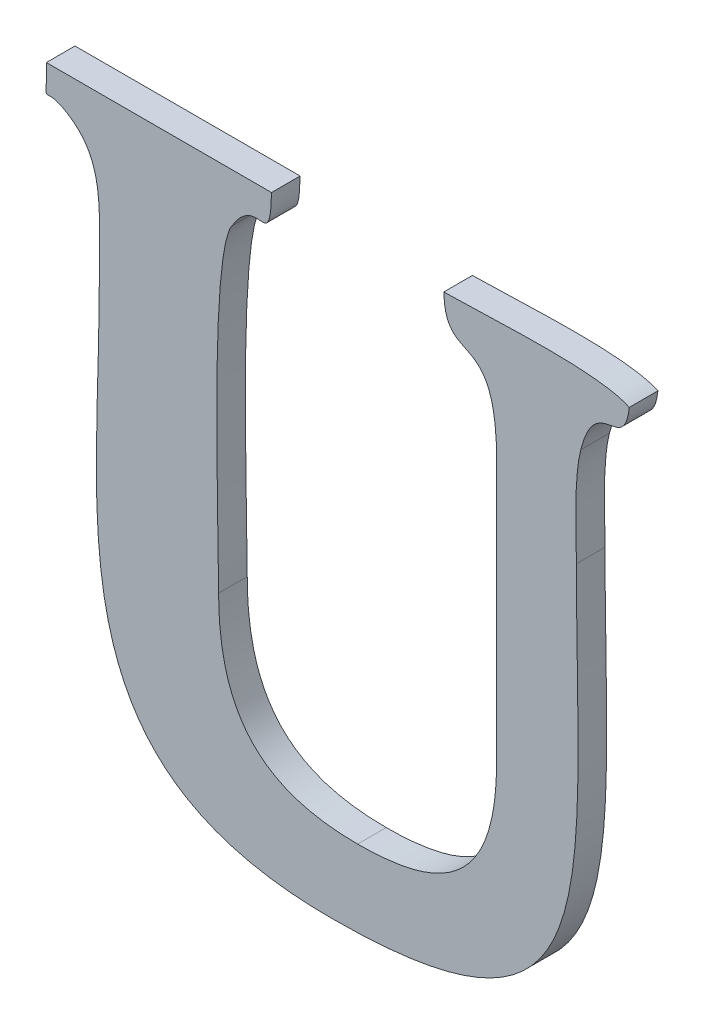
ISO-10303-21;
HEADER;
FILE_DESCRIPTION(('STEP AP214'),'2;1');
FILE_NAME('part.step','',(''),(''),'','','');
FILE_SCHEMA(('AUTOMOTIVE_DESIGN { 1 0 10303 214 1 1 1 1 }'));
ENDSEC;
DATA;
#1=APPLICATION_CONTEXT('core data for automotive mechanical design processes');
#2=APPLICATION_PROTOCOL_DEFINITION('international standard','automotive_design',2000,#1);
#3=PRODUCT_CONTEXT('',#1,'mechanical');
#4=PRODUCT('Part','Part','',(#3));
#5=PRODUCT_RELATED_PRODUCT_CATEGORY('part','',(#4));
#6=PRODUCT_DEFINITION_FORMATION('','',#4);
#7=PRODUCT_DEFINITION_CONTEXT('part definition',#1,'design');
#8=PRODUCT_DEFINITION('design','',#6,#7);
#9=PRODUCT_DEFINITION_SHAPE('','',#8);
#10=(LENGTH_UNIT() NAMED_UNIT(*) SI_UNIT(.MILLI.,.METRE.));
#11=(NAMED_UNIT(*) PLANE_ANGLE_UNIT() SI_UNIT($,.RADIAN.));
#12=(NAMED_UNIT(*) SI_UNIT($,.STERADIAN.) SOLID_ANGLE_UNIT());
#13=UNCERTAINTY_MEASURE_WITH_UNIT(LENGTH_MEASURE(1.E-05),#10,'distance_accuracy_value','');
#14=(GEOMETRIC_REPRESENTATION_CONTEXT(3) GLOBAL_UNCERTAINTY_ASSIGNED_CONTEXT((#13)) GLOBAL_UNIT_ASSIGNED_CONTEXT((#10,
#11,#12)) REPRESENTATION_CONTEXT('',''));
#15=CARTESIAN_POINT('',(0.,0.,0.));
#16=DIRECTION('',(0.,0.,1.));
#17=DIRECTION('',(1.,0.,0.));
#18=AXIS2_PLACEMENT_3D('',#15,#16,#17);
#19=CARTESIAN_POINT('',(50.2041499999998,11.218749,0.001));
#20=CARTESIAN_POINT('',(50.2041499999998,11.218749,0.));
#21=CARTESIAN_POINT('',(50.2054939999998,11.217909,0.001));
#22=CARTESIAN_POINT('',(50.2054939999998,11.217909,0.));
#23=CARTESIAN_POINT('',(50.2052559999998,11.216369,0.001));
#24=CARTESIAN_POINT('',(50.2052559999998,11.216369,0.));
#25=CARTESIAN_POINT('',(50.2052559999998,11.214017,0.001));
#26=CARTESIAN_POINT('',(50.2052559999998,11.214017,0.));
#27=B_SPLINE_SURFACE_WITH_KNOTS('',3,1,((#19,#20),(#21,#22),(#23,#24),(#25,#26)),.UNSPECIFIED.,
.F.,.F.,.F.,(4,4),(2,2),(0.8,0.866666666666667),(0.,1.),.UNSPECIFIED.);
#28=CARTESIAN_POINT('',(50.2041499999998,11.218749,0.));
#29=CARTESIAN_POINT('',(50.2054939999998,11.217909,0.));
#30=CARTESIAN_POINT('',(50.2052559999998,11.216369,0.));
#31=CARTESIAN_POINT('',(50.2052559999998,11.214017,0.));
#32=B_SPLINE_CURVE_WITH_KNOTS('',3,(#28,#29,#30,#31),.UNSPECIFIED.,.F.,.F.,(4,4),(0.8,
0.866666666666667),.UNSPECIFIED.);
#33=CARTESIAN_POINT('',(50.2041499999998,11.218749,0.));
#34=VERTEX_POINT('',#33);
#35=CARTESIAN_POINT('',(50.2052559999998,11.214017,0.));
#36=VERTEX_POINT('',#35);
#37=EDGE_CURVE('E11',#34,#36,#32,.T.);
#38=DIRECTION('',(0.,0.,-1.));
#39=VECTOR('',#38,1.);
#40=CARTESIAN_POINT('',(50.2052559999998,11.214017,0.001));
#41=LINE('',#40,#39);
#42=CARTESIAN_POINT('',(50.2052559999998,11.214017,0.001));
#43=VERTEX_POINT('',#42);
#44=EDGE_CURVE('E28',#43,#36,#41,.T.);
#45=CARTESIAN_POINT('',(50.2041499999998,11.218749,0.001));
#46=CARTESIAN_POINT('',(50.2054939999998,11.217909,0.001));
#47=CARTESIAN_POINT('',(50.2052559999998,11.216369,0.001));
#48=CARTESIAN_POINT('',(50.2052559999998,11.214017,0.001));
#49=B_SPLINE_CURVE_WITH_KNOTS('',3,(#45,#46,#47,#48),.UNSPECIFIED.,.F.,.F.,(4,4),(0.8,
0.866666666666667),.UNSPECIFIED.);
#50=CARTESIAN_POINT('',(50.2041499999998,11.218749,0.001));
#51=VERTEX_POINT('',#50);
#52=EDGE_CURVE('E333',#51,#43,#49,.T.);
#53=DIRECTION('',(0.,0.,-1.));
#54=VECTOR('',#53,1.);
#55=CARTESIAN_POINT('',(50.2041499999998,11.218749,0.001));
#56=LINE('',#55,#54);
#57=EDGE_CURVE('E40',#51,#34,#56,.T.);
#58=ORIENTED_EDGE('',*,*,#37,.T.);
#59=ORIENTED_EDGE('',*,*,#44,.F.);
#60=ORIENTED_EDGE('',*,*,#52,.F.);
#61=ORIENTED_EDGE('',*,*,#57,.T.);
#62=EDGE_LOOP('',(#58,#59,#60,#61));
#63=FACE_BOUND('',#62,.T.);
#64=ADVANCED_FACE('F17',(#63),#27,.F.);
#65=CARTESIAN_POINT('',(50.2052559999998,11.214017,0.001));
#66=CARTESIAN_POINT('',(50.2052559999998,11.214017,0.));
#67=CARTESIAN_POINT('',(50.2052419999998,11.206611,0.001));
#68=CARTESIAN_POINT('',(50.2052419999998,11.206611,0.));
#69=CARTESIAN_POINT('',(50.2036739999998,11.199009,0.001));
#70=CARTESIAN_POINT('',(50.2036739999998,11.199009,0.));
#71=CARTESIAN_POINT('',(50.2133619999998,11.199009,0.001));
#72=CARTESIAN_POINT('',(50.2133619999998,11.199009,0.));
#73=B_SPLINE_SURFACE_WITH_KNOTS('',3,1,((#65,#66),(#67,#68),(#69,#70),(#71,#72)),.UNSPECIFIED.,
.F.,.F.,.F.,(4,4),(2,2),(0.866666666666667,1.),(0.,1.),.UNSPECIFIED.);
#74=CARTESIAN_POINT('',(50.2052559999998,11.214017,0.));
#75=CARTESIAN_POINT('',(50.2052419999998,11.206611,0.));
#76=CARTESIAN_POINT('',(50.2036739999998,11.199009,0.));
#77=CARTESIAN_POINT('',(50.2133619999998,11.199009,0.));
#78=B_SPLINE_CURVE_WITH_KNOTS('',3,(#74,#75,#76,#77),.UNSPECIFIED.,.F.,.F.,(4,4),
(0.866666666666667,1.),.UNSPECIFIED.);
#79=CARTESIAN_POINT('',(50.2133619999998,11.199009,0.));
#80=VERTEX_POINT('',#79);
#81=EDGE_CURVE('E325',#36,#80,#78,.T.);
#82=DIRECTION('',(0.,0.,-1.));
#83=VECTOR('',#82,1.);
#84=CARTESIAN_POINT('',(50.2133619999998,11.199009,0.001));
#85=LINE('',#84,#83);
#86=CARTESIAN_POINT('',(50.2133619999998,11.199009,0.001));
#87=VERTEX_POINT('',#86);
#88=EDGE_CURVE('E320',#87,#80,#85,.T.);
#89=CARTESIAN_POINT('',(50.2052559999998,11.214017,0.001));
#90=CARTESIAN_POINT('',(50.2052419999998,11.206611,0.001));
#91=CARTESIAN_POINT('',(50.2036739999998,11.199009,0.001));
#92=CARTESIAN_POINT('',(50.2133619999998,11.199009,0.001));
#93=B_SPLINE_CURVE_WITH_KNOTS('',3,(#89,#90,#91,#92),.UNSPECIFIED.,.F.,.F.,(4,4),
(0.866666666666667,1.),.UNSPECIFIED.);
#94=EDGE_CURVE('E313',#43,#87,#93,.T.);
#95=ORIENTED_EDGE('',*,*,#81,.T.);
#96=ORIENTED_EDGE('',*,*,#88,.F.);
#97=ORIENTED_EDGE('',*,*,#94,.F.);
#98=ORIENTED_EDGE('',*,*,#44,.T.);
#99=EDGE_LOOP('',(#95,#96,#97,#98));
#100=FACE_BOUND('',#99,.T.);
#101=ADVANCED_FACE('F341',(#100),#73,.F.);
#102=CARTESIAN_POINT('',(50.2133619999998,11.199009,0.001));
#103=CARTESIAN_POINT('',(50.2133619999998,11.199009,0.));
#104=CARTESIAN_POINT('',(50.2232039999998,11.199009,0.001));
#105=CARTESIAN_POINT('',(50.2232039999998,11.199009,0.));
#106=CARTESIAN_POINT('',(50.2219439999998,11.203979,0.001));
#107=CARTESIAN_POINT('',(50.2219439999998,11.203979,0.));
#108=CARTESIAN_POINT('',(50.2219299999998,11.214017,0.001));
#109=CARTESIAN_POINT('',(50.2219299999998,11.214017,0.));
#110=B_SPLINE_SURFACE_WITH_KNOTS('',3,1,((#102,#103),(#104,#105),(#106,#107),(#108,#109)),
.UNSPECIFIED.,.F.,.F.,.F.,(4,4),(2,2),(0.,0.0666666666666667),(0.,1.),.UNSPECIFIED.);
#111=CARTESIAN_POINT('',(50.2133619999998,11.199009,0.));
#112=CARTESIAN_POINT('',(50.2232039999998,11.199009,0.));
#113=CARTESIAN_POINT('',(50.2219439999998,11.203979,0.));
#114=CARTESIAN_POINT('',(50.2219299999998,11.214017,0.));
#115=B_SPLINE_CURVE_WITH_KNOTS('',3,(#111,#112,#113,#114),.UNSPECIFIED.,.F.,.F.,(4,4),(0.,
0.0666666666666667),.UNSPECIFIED.);
#116=CARTESIAN_POINT('',(50.2219299999998,11.214017,0.));
#117=VERTEX_POINT('',#116);
#118=EDGE_CURVE('E308',#80,#117,#115,.T.);
#119=DIRECTION('',(0.,0.,-1.));
#120=VECTOR('',#119,1.);
#121=CARTESIAN_POINT('',(50.2219299999998,11.214017,0.001));
#122=LINE('',#121,#120);
#123=CARTESIAN_POINT('',(50.2219299999998,11.214017,0.001));
#124=VERTEX_POINT('',#123);
#125=EDGE_CURVE('E303',#124,#117,#122,.T.);
#126=CARTESIAN_POINT('',(50.2133619999998,11.199009,0.001));
#127=CARTESIAN_POINT('',(50.2232039999998,11.199009,0.001));
#128=CARTESIAN_POINT('',(50.2219439999998,11.203979,0.001));
#129=CARTESIAN_POINT('',(50.2219299999998,11.214017,0.001));
#130=B_SPLINE_CURVE_WITH_KNOTS('',3,(#126,#127,#128,#129),.UNSPECIFIED.,.F.,.F.,(4,4),(0.,
0.0666666666666667),.UNSPECIFIED.);
#131=EDGE_CURVE('E296',#87,#124,#130,.T.);
#132=ORIENTED_EDGE('',*,*,#118,.T.);
#133=ORIENTED_EDGE('',*,*,#125,.F.);
#134=ORIENTED_EDGE('',*,*,#131,.F.);
#135=ORIENTED_EDGE('',*,*,#88,.T.);
#136=EDGE_LOOP('',(#132,#133,#134,#135));
#137=FACE_BOUND('',#136,.T.);
#138=ADVANCED_FACE('F346',(#137),#110,.F.);
#139=CARTESIAN_POINT('',(50.2219299999998,11.214017,0.001));
#140=CARTESIAN_POINT('',(50.2219299999998,11.214017,0.));
#141=CARTESIAN_POINT('',(50.2219299999998,11.215151,0.001));
#142=CARTESIAN_POINT('',(50.2219299999998,11.215151,0.));
#143=CARTESIAN_POINT('',(50.2218319999998,11.216523,0.001));
#144=CARTESIAN_POINT('',(50.2218319999998,11.216523,0.));
#145=CARTESIAN_POINT('',(50.2220839999998,11.217545,0.001));
#146=CARTESIAN_POINT('',(50.2220839999998,11.217545,0.));
#147=B_SPLINE_SURFACE_WITH_KNOTS('',3,1,((#139,#140),(#141,#142),(#143,#144),(#145,#146)),
.UNSPECIFIED.,.F.,.F.,.F.,(4,4),(2,2),(0.0666666666666667,0.133333333333333),(0.,1.),.UNSPECIFIED.);
#148=CARTESIAN_POINT('',(50.2219299999998,11.214017,0.));
#149=CARTESIAN_POINT('',(50.2219299999998,11.215151,0.));
#150=CARTESIAN_POINT('',(50.2218319999998,11.216523,0.));
#151=CARTESIAN_POINT('',(50.2220839999998,11.217545,0.));
#152=B_SPLINE_CURVE_WITH_KNOTS('',3,(#148,#149,#150,#151),.UNSPECIFIED.,.F.,.F.,(4,4),
(0.0666666666666667,0.133333333333333),.UNSPECIFIED.);
#153=CARTESIAN_POINT('',(50.2220839999998,11.217545,0.));
#154=VERTEX_POINT('',#153);
#155=EDGE_CURVE('E291',#117,#154,#152,.T.);
#156=DIRECTION('',(0.,0.,-1.));
#157=VECTOR('',#156,1.);
#158=CARTESIAN_POINT('',(50.2220839999998,11.217545,0.001));
#159=LINE('',#158,#157);
#160=CARTESIAN_POINT('',(50.2220839999998,11.217545,0.001));
#161=VERTEX_POINT('',#160);
#162=EDGE_CURVE('E286',#161,#154,#159,.T.);
#163=CARTESIAN_POINT('',(50.2219299999998,11.214017,0.001));
#164=CARTESIAN_POINT('',(50.2219299999998,11.215151,0.001));
#165=CARTESIAN_POINT('',(50.2218319999998,11.216523,0.001));
#166=CARTESIAN_POINT('',(50.2220839999998,11.217545,0.001));
#167=B_SPLINE_CURVE_WITH_KNOTS('',3,(#163,#164,#165,#166),.UNSPECIFIED.,.F.,.F.,(4,4),
(0.0666666666666667,0.133333333333333),.UNSPECIFIED.);
#168=EDGE_CURVE('E279',#124,#161,#167,.T.);
#169=ORIENTED_EDGE('',*,*,#155,.T.);
#170=ORIENTED_EDGE('',*,*,#162,.F.);
#171=ORIENTED_EDGE('',*,*,#168,.F.);
#172=ORIENTED_EDGE('',*,*,#125,.T.);
#173=EDGE_LOOP('',(#169,#170,#171,#172));
#174=FACE_BOUND('',#173,.T.);
#175=ADVANCED_FACE('F352',(#174),#147,.F.);
#176=CARTESIAN_POINT('',(50.2220839999998,11.217545,0.001));
#177=CARTESIAN_POINT('',(50.2220839999998,11.217545,0.));
#178=CARTESIAN_POINT('',(50.2226159999998,11.219645,0.001));
#179=CARTESIAN_POINT('',(50.2226159999998,11.219645,0.));
#180=CARTESIAN_POINT('',(50.2235959999998,11.218049,0.001));
#181=CARTESIAN_POINT('',(50.2235959999998,11.218049,0.));
#182=CARTESIAN_POINT('',(50.2237779999998,11.219673,0.001));
#183=CARTESIAN_POINT('',(50.2237779999998,11.219673,0.));
#184=B_SPLINE_SURFACE_WITH_KNOTS('',3,1,((#176,#177),(#178,#179),(#180,#181),(#182,#183)),
.UNSPECIFIED.,.F.,.F.,.F.,(4,4),(2,2),(0.133333333333333,0.2),(0.,1.),.UNSPECIFIED.);
#185=CARTESIAN_POINT('',(50.2220839999998,11.217545,0.));
#186=CARTESIAN_POINT('',(50.2226159999998,11.219645,0.));
#187=CARTESIAN_POINT('',(50.2235959999998,11.218049,0.));
#188=CARTESIAN_POINT('',(50.2237779999998,11.219673,0.));
#189=B_SPLINE_CURVE_WITH_KNOTS('',3,(#185,#186,#187,#188),.UNSPECIFIED.,.F.,.F.,(4,4),
(0.133333333333333,0.2),.UNSPECIFIED.);
#190=CARTESIAN_POINT('',(50.2237779999998,11.219673,0.));
#191=VERTEX_POINT('',#190);
#192=EDGE_CURVE('E274',#154,#191,#189,.T.);
#193=DIRECTION('',(0.,0.,-1.));
#194=VECTOR('',#193,1.);
#195=CARTESIAN_POINT('',(50.2237779999998,11.219673,0.001));
#196=LINE('',#195,#194);
#197=CARTESIAN_POINT('',(50.2237779999998,11.219673,0.001));
#198=VERTEX_POINT('',#197);
#199=EDGE_CURVE('E269',#198,#191,#196,.T.);
#200=CARTESIAN_POINT('',(50.2220839999998,11.217545,0.001));
#201=CARTESIAN_POINT('',(50.2226159999998,11.219645,0.001));
#202=CARTESIAN_POINT('',(50.2235959999998,11.218049,0.001));
#203=CARTESIAN_POINT('',(50.2237779999998,11.219673,0.001));
#204=B_SPLINE_CURVE_WITH_KNOTS('',3,(#200,#201,#202,#203),.UNSPECIFIED.,.F.,.F.,(4,4),
(0.133333333333333,0.2),.UNSPECIFIED.);
#205=EDGE_CURVE('E262',#161,#198,#204,.T.);
#206=ORIENTED_EDGE('',*,*,#192,.T.);
#207=ORIENTED_EDGE('',*,*,#199,.F.);
#208=ORIENTED_EDGE('',*,*,#205,.F.);
#209=ORIENTED_EDGE('',*,*,#162,.T.);
#210=EDGE_LOOP('',(#206,#207,#208,#209));
#211=FACE_BOUND('',#210,.T.);
#212=ADVANCED_FACE('F356',(#211),#184,.F.);
#213=CARTESIAN_POINT('',(50.2237779999998,11.219673,0.001));
#214=CARTESIAN_POINT('',(50.2237779999998,11.219673,0.));
#215=CARTESIAN_POINT('',(50.2226579999998,11.220233,0.001));
#216=CARTESIAN_POINT('',(50.2226579999998,11.220233,0.));
#217=CARTESIAN_POINT('',(50.2187379999998,11.219925,0.001));
#218=CARTESIAN_POINT('',(50.2187379999998,11.219925,0.));
#219=CARTESIAN_POINT('',(50.2172959999998,11.219925,0.001));
#220=CARTESIAN_POINT('',(50.2172959999998,11.219925,0.));
#221=B_SPLINE_SURFACE_WITH_KNOTS('',3,1,((#213,#214),(#215,#216),(#217,#218),(#219,#220)),
.UNSPECIFIED.,.F.,.F.,.F.,(4,4),(2,2),(0.2,0.266666666666667),(0.,1.),.UNSPECIFIED.);
#222=CARTESIAN_POINT('',(50.2237779999998,11.219673,0.));
#223=CARTESIAN_POINT('',(50.2226579999998,11.220233,0.));
#224=CARTESIAN_POINT('',(50.2187379999998,11.219925,0.));
#225=CARTESIAN_POINT('',(50.2172959999998,11.219925,0.));
#226=B_SPLINE_CURVE_WITH_KNOTS('',3,(#222,#223,#224,#225),.UNSPECIFIED.,.F.,.F.,(4,4),(0.2,
0.266666666666667),.UNSPECIFIED.);
#227=CARTESIAN_POINT('',(50.2172959999998,11.219925,0.));
#228=VERTEX_POINT('',#227);
#229=EDGE_CURVE('E257',#191,#228,#226,.T.);
#230=DIRECTION('',(0.,0.,-1.));
#231=VECTOR('',#230,1.);
#232=CARTESIAN_POINT('',(50.2172959999998,11.219925,0.001));
#233=LINE('',#232,#231);
#234=CARTESIAN_POINT('',(50.2172959999998,11.219925,0.001));
#235=VERTEX_POINT('',#234);
#236=EDGE_CURVE('E252',#235,#228,#233,.T.);
#237=CARTESIAN_POINT('',(50.2237779999998,11.219673,0.001));
#238=CARTESIAN_POINT('',(50.2226579999998,11.220233,0.001));
#239=CARTESIAN_POINT('',(50.2187379999998,11.219925,0.001));
#240=CARTESIAN_POINT('',(50.2172959999998,11.219925,0.001));
#241=B_SPLINE_CURVE_WITH_KNOTS('',3,(#237,#238,#239,#240),.UNSPECIFIED.,.F.,.F.,(4,4),(0.2,
0.266666666666667),.UNSPECIFIED.);
#242=EDGE_CURVE('E245',#198,#235,#241,.T.);
#243=ORIENTED_EDGE('',*,*,#229,.T.);
#244=ORIENTED_EDGE('',*,*,#236,.F.);
#245=ORIENTED_EDGE('',*,*,#242,.F.);
#246=ORIENTED_EDGE('',*,*,#199,.T.);
#247=EDGE_LOOP('',(#243,#244,#245,#246));
#248=FACE_BOUND('',#247,.T.);
#249=ADVANCED_FACE('F361',(#248),#221,.F.);
#250=CARTESIAN_POINT('',(50.2172959999998,11.219925,0.001));
#251=CARTESIAN_POINT('',(50.2172959999998,11.219925,0.));
#252=CARTESIAN_POINT('',(50.2173519999998,11.217657,0.001));
#253=CARTESIAN_POINT('',(50.2173519999998,11.217657,0.));
#254=CARTESIAN_POINT('',(50.2191439999998,11.219785,0.001));
#255=CARTESIAN_POINT('',(50.2191439999998,11.219785,0.));
#256=CARTESIAN_POINT('',(50.2191439999998,11.215739,0.001));
#257=CARTESIAN_POINT('',(50.2191439999998,11.215739,0.));
#258=B_SPLINE_SURFACE_WITH_KNOTS('',3,1,((#250,#251),(#252,#253),(#254,#255),(#256,#257)),
.UNSPECIFIED.,.F.,.F.,.F.,(4,4),(2,2),(0.266666666666667,0.333333333333333),(0.,1.),.UNSPECIFIED.);
#259=CARTESIAN_POINT('',(50.2172959999998,11.219925,0.));
#260=CARTESIAN_POINT('',(50.2173519999998,11.217657,0.));
#261=CARTESIAN_POINT('',(50.2191439999998,11.219785,0.));
#262=CARTESIAN_POINT('',(50.2191439999998,11.215739,0.));
#263=B_SPLINE_CURVE_WITH_KNOTS('',3,(#259,#260,#261,#262),.UNSPECIFIED.,.F.,.F.,(4,4),
(0.266666666666667,0.333333333333333),.UNSPECIFIED.);
#264=CARTESIAN_POINT('',(50.2191439999998,11.215739,0.));
#265=VERTEX_POINT('',#264);
#266=EDGE_CURVE('E240',#228,#265,#263,.T.);
#267=DIRECTION('',(0.,0.,-1.));
#268=VECTOR('',#267,1.);
#269=CARTESIAN_POINT('',(50.2191439999998,11.215739,0.001));
#270=LINE('',#269,#268);
#271=CARTESIAN_POINT('',(50.2191439999998,11.215739,0.001));
#272=VERTEX_POINT('',#271);
#273=EDGE_CURVE('E235',#272,#265,#270,.T.);
#274=CARTESIAN_POINT('',(50.2172959999998,11.219925,0.001));
#275=CARTESIAN_POINT('',(50.2173519999998,11.217657,0.001));
#276=CARTESIAN_POINT('',(50.2191439999998,11.219785,0.001));
#277=CARTESIAN_POINT('',(50.2191439999998,11.215739,0.001));
#278=B_SPLINE_CURVE_WITH_KNOTS('',3,(#274,#275,#276,#277),.UNSPECIFIED.,.F.,.F.,(4,4),
(0.266666666666667,0.333333333333333),.UNSPECIFIED.);
#279=EDGE_CURVE('E231',#235,#272,#278,.T.);
#280=ORIENTED_EDGE('',*,*,#266,.T.);
#281=ORIENTED_EDGE('',*,*,#273,.F.);
#282=ORIENTED_EDGE('',*,*,#279,.F.);
#283=ORIENTED_EDGE('',*,*,#236,.T.);
#284=EDGE_LOOP('',(#280,#281,#282,#283));
#285=FACE_BOUND('',#284,.T.);
#286=ADVANCED_FACE('F367',(#285),#258,.F.);
#287=CARTESIAN_POINT('',(50.2191439999998,0.,0.001));
#288=DIRECTION('',(1.,0.,0.));
#289=DIRECTION('',(0.,0.,-1.));
#290=AXIS2_PLACEMENT_3D('',#287,#288,#289);
#291=PLANE('',#290);
#292=DIRECTION('',(0.,-1.,0.));
#293=VECTOR('',#292,1.);
#294=CARTESIAN_POINT('',(50.2191439999998,0.,0.));
#295=LINE('',#294,#293);
#296=CARTESIAN_POINT('',(50.2191439999998,11.206639,0.));
#297=VERTEX_POINT('',#296);
#298=EDGE_CURVE('E229',#265,#297,#295,.T.);
#299=ORIENTED_EDGE('',*,*,#298,.T.);
#300=DIRECTION('',(0.,0.,-1.));
#301=VECTOR('',#300,1.);
#302=CARTESIAN_POINT('',(50.2191439999998,11.206639,0.001));
#303=LINE('',#302,#301);
#304=CARTESIAN_POINT('',(50.2191439999998,11.206639,0.001));
#305=VERTEX_POINT('',#304);
#306=EDGE_CURVE('E226',#305,#297,#303,.T.);
#307=ORIENTED_EDGE('',*,*,#306,.F.);
#308=DIRECTION('',(0.,-1.,0.));
#309=VECTOR('',#308,1.);
#310=CARTESIAN_POINT('',(50.2191439999998,0.,0.001));
#311=LINE('',#310,#309);
#312=EDGE_CURVE('E220',#272,#305,#311,.T.);
#313=ORIENTED_EDGE('',*,*,#312,.F.);
#314=ORIENTED_EDGE('',*,*,#273,.T.);
#315=EDGE_LOOP('',(#299,#307,#313,#314));
#316=FACE_BOUND('',#315,.T.);
#317=ADVANCED_FACE('F371',(#316),#291,.F.);
#318=CARTESIAN_POINT('',(50.2191439999998,11.206639,0.001));
#319=CARTESIAN_POINT('',(50.2191439999998,11.206639,0.));
#320=CARTESIAN_POINT('',(50.2191439999998,11.202957,0.001));
#321=CARTESIAN_POINT('',(50.2191439999998,11.202957,0.));
#322=CARTESIAN_POINT('',(50.2174779999998,11.201711,0.001));
#323=CARTESIAN_POINT('',(50.2174779999998,11.201711,0.));
#324=CARTESIAN_POINT('',(50.2142859999998,11.201711,0.001));
#325=CARTESIAN_POINT('',(50.2142859999998,11.201711,0.));
#326=B_SPLINE_SURFACE_WITH_KNOTS('',3,1,((#318,#319),(#320,#321),(#322,#323),(#324,#325)),
.UNSPECIFIED.,.F.,.F.,.F.,(4,4),(2,2),(0.4,0.466666666666667),(0.,1.),.UNSPECIFIED.);
#327=CARTESIAN_POINT('',(50.2191439999998,11.206639,0.));
#328=CARTESIAN_POINT('',(50.2191439999998,11.202957,0.));
#329=CARTESIAN_POINT('',(50.2174779999998,11.201711,0.));
#330=CARTESIAN_POINT('',(50.2142859999998,11.201711,0.));
#331=B_SPLINE_CURVE_WITH_KNOTS('',3,(#327,#328,#329,#330),.UNSPECIFIED.,.F.,.F.,(4,4),(0.4,
0.466666666666667),.UNSPECIFIED.);
#332=CARTESIAN_POINT('',(50.2142859999998,11.201711,0.));
#333=VERTEX_POINT('',#332);
#334=EDGE_CURVE('E215',#297,#333,#331,.T.);
#335=DIRECTION('',(0.,0.,-1.));
#336=VECTOR('',#335,1.);
#337=CARTESIAN_POINT('',(50.2142859999998,11.201711,0.001));
#338=LINE('',#337,#336);
#339=CARTESIAN_POINT('',(50.2142859999998,11.201711,0.001));
#340=VERTEX_POINT('',#339);
#341=EDGE_CURVE('E210',#340,#333,#338,.T.);
#342=CARTESIAN_POINT('',(50.2191439999998,11.206639,0.001));
#343=CARTESIAN_POINT('',(50.2191439999998,11.202957,0.001));
#344=CARTESIAN_POINT('',(50.2174779999998,11.201711,0.001));
#345=CARTESIAN_POINT('',(50.2142859999998,11.201711,0.001));
#346=B_SPLINE_CURVE_WITH_KNOTS('',3,(#342,#343,#344,#345),.UNSPECIFIED.,.F.,.F.,(4,4),(0.4,
0.466666666666667),.UNSPECIFIED.);
#347=EDGE_CURVE('E203',#305,#340,#346,.T.);
#348=ORIENTED_EDGE('',*,*,#334,.T.);
#349=ORIENTED_EDGE('',*,*,#341,.F.);
#350=ORIENTED_EDGE('',*,*,#347,.F.);
#351=ORIENTED_EDGE('',*,*,#306,.T.);
#352=EDGE_LOOP('',(#348,#349,#350,#351));
#353=FACE_BOUND('',#352,.T.);
#354=ADVANCED_FACE('F374',(#353),#326,.F.);
#355=CARTESIAN_POINT('',(50.2142859999998,11.201711,0.001));
#356=CARTESIAN_POINT('',(50.2142859999998,11.201711,0.));
#357=CARTESIAN_POINT('',(50.2109259999998,11.201711,0.001));
#358=CARTESIAN_POINT('',(50.2109259999998,11.201711,0.));
#359=CARTESIAN_POINT('',(50.2094279999998,11.203293,0.001));
#360=CARTESIAN_POINT('',(50.2094279999998,11.203293,0.));
#361=CARTESIAN_POINT('',(50.2094279999998,11.206877,0.001));
#362=CARTESIAN_POINT('',(50.2094279999998,11.206877,0.));
#363=B_SPLINE_SURFACE_WITH_KNOTS('',3,1,((#355,#356),(#357,#358),(#359,#360),(#361,#362)),
.UNSPECIFIED.,.F.,.F.,.F.,(4,4),(2,2),(0.466666666666667,0.533333333333333),(0.,1.),.UNSPECIFIED.);
#364=CARTESIAN_POINT('',(50.2142859999998,11.201711,0.));
#365=CARTESIAN_POINT('',(50.2109259999998,11.201711,0.));
#366=CARTESIAN_POINT('',(50.2094279999998,11.203293,0.));
#367=CARTESIAN_POINT('',(50.2094279999998,11.206877,0.));
#368=B_SPLINE_CURVE_WITH_KNOTS('',3,(#364,#365,#366,#367),.UNSPECIFIED.,.F.,.F.,(4,4),
(0.466666666666667,0.533333333333333),.UNSPECIFIED.);
#369=CARTESIAN_POINT('',(50.2094279999998,11.206877,0.));
#370=VERTEX_POINT('',#369);
#371=EDGE_CURVE('E198',#333,#370,#368,.T.);
#372=DIRECTION('',(0.,0.,-1.));
#373=VECTOR('',#372,1.);
#374=CARTESIAN_POINT('',(50.2094279999998,11.206877,0.001));
#375=LINE('',#374,#373);
#376=CARTESIAN_POINT('',(50.2094279999998,11.206877,0.001));
#377=VERTEX_POINT('',#376);
#378=EDGE_CURVE('E193',#377,#370,#375,.T.);
#379=CARTESIAN_POINT('',(50.2142859999998,11.201711,0.001));
#380=CARTESIAN_POINT('',(50.2109259999998,11.201711,0.001));
#381=CARTESIAN_POINT('',(50.2094279999998,11.203293,0.001));
#382=CARTESIAN_POINT('',(50.2094279999998,11.206877,0.001));
#383=B_SPLINE_CURVE_WITH_KNOTS('',3,(#379,#380,#381,#382),.UNSPECIFIED.,.F.,.F.,(4,4),
(0.466666666666667,0.533333333333333),.UNSPECIFIED.);
#384=EDGE_CURVE('E186',#340,#377,#383,.T.);
#385=ORIENTED_EDGE('',*,*,#371,.T.);
#386=ORIENTED_EDGE('',*,*,#378,.F.);
#387=ORIENTED_EDGE('',*,*,#384,.F.);
#388=ORIENTED_EDGE('',*,*,#341,.T.);
#389=EDGE_LOOP('',(#385,#386,#387,#388));
#390=FACE_BOUND('',#389,.T.);
#391=ADVANCED_FACE('F383',(#390),#363,.F.);
#392=CARTESIAN_POINT('',(50.2094279999998,11.206877,0.001));
#393=CARTESIAN_POINT('',(50.2094279999998,11.206877,0.));
#394=CARTESIAN_POINT('',(50.2094279999998,11.208935,0.001));
#395=CARTESIAN_POINT('',(50.2094279999998,11.208935,0.));
#396=CARTESIAN_POINT('',(50.2091059999998,11.216929,0.001));
#397=CARTESIAN_POINT('',(50.2091059999998,11.216929,0.));
#398=CARTESIAN_POINT('',(50.2098759999998,11.218203,0.001));
#399=CARTESIAN_POINT('',(50.2098759999998,11.218203,0.));
#400=B_SPLINE_SURFACE_WITH_KNOTS('',3,1,((#392,#393),(#394,#395),(#396,#397),(#398,#399)),
.UNSPECIFIED.,.F.,.F.,.F.,(4,4),(2,2),(0.533333333333333,0.6),(0.,1.),.UNSPECIFIED.);
#401=CARTESIAN_POINT('',(50.2094279999998,11.206877,0.));
#402=CARTESIAN_POINT('',(50.2094279999998,11.208935,0.));
#403=CARTESIAN_POINT('',(50.2091059999998,11.216929,0.));
#404=CARTESIAN_POINT('',(50.2098759999998,11.218203,0.));
#405=B_SPLINE_CURVE_WITH_KNOTS('',3,(#401,#402,#403,#404),.UNSPECIFIED.,.F.,.F.,(4,4),
(0.533333333333333,0.6),.UNSPECIFIED.);
#406=CARTESIAN_POINT('',(50.2098759999998,11.218203,0.));
#407=VERTEX_POINT('',#406);
#408=EDGE_CURVE('E181',#370,#407,#405,.T.);
#409=DIRECTION('',(0.,0.,-1.));
#410=VECTOR('',#409,1.);
#411=CARTESIAN_POINT('',(50.2098759999998,11.218203,0.001));
#412=LINE('',#411,#410);
#413=CARTESIAN_POINT('',(50.2098759999998,11.218203,0.001));
#414=VERTEX_POINT('',#413);
#415=EDGE_CURVE('E176',#414,#407,#412,.T.);
#416=CARTESIAN_POINT('',(50.2094279999998,11.206877,0.001));
#417=CARTESIAN_POINT('',(50.2094279999998,11.208935,0.001));
#418=CARTESIAN_POINT('',(50.2091059999998,11.216929,0.001));
#419=CARTESIAN_POINT('',(50.2098759999998,11.218203,0.001));
#420=B_SPLINE_CURVE_WITH_KNOTS('',3,(#416,#417,#418,#419),.UNSPECIFIED.,.F.,.F.,(4,4),
(0.533333333333333,0.6),.UNSPECIFIED.);
#421=EDGE_CURVE('E169',#377,#414,#420,.T.);
#422=ORIENTED_EDGE('',*,*,#408,.T.);
#423=ORIENTED_EDGE('',*,*,#415,.F.);
#424=ORIENTED_EDGE('',*,*,#421,.F.);
#425=ORIENTED_EDGE('',*,*,#378,.T.);
#426=EDGE_LOOP('',(#422,#423,#424,#425));
#427=FACE_BOUND('',#426,.T.);
#428=ADVANCED_FACE('F388',(#427),#400,.F.);
#429=CARTESIAN_POINT('',(50.2098759999998,11.218203,0.001));
#430=CARTESIAN_POINT('',(50.2098759999998,11.218203,0.));
#431=CARTESIAN_POINT('',(50.2107999999998,11.219729,0.001));
#432=CARTESIAN_POINT('',(50.2107999999998,11.219729,0.));
#433=CARTESIAN_POINT('',(50.2112339999998,11.217895,0.001));
#434=CARTESIAN_POINT('',(50.2112339999998,11.217895,0.));
#435=CARTESIAN_POINT('',(50.2112759999998,11.219925,0.001));
#436=CARTESIAN_POINT('',(50.2112759999998,11.219925,0.));
#437=B_SPLINE_SURFACE_WITH_KNOTS('',3,1,((#429,#430),(#431,#432),(#433,#434),(#435,#436)),
.UNSPECIFIED.,.F.,.F.,.F.,(4,4),(2,2),(0.6,0.666666666666667),(0.,1.),.UNSPECIFIED.);
#438=CARTESIAN_POINT('',(50.2098759999998,11.218203,0.));
#439=CARTESIAN_POINT('',(50.2107999999998,11.219729,0.));
#440=CARTESIAN_POINT('',(50.2112339999998,11.217895,0.));
#441=CARTESIAN_POINT('',(50.2112759999998,11.219925,0.));
#442=B_SPLINE_CURVE_WITH_KNOTS('',3,(#438,#439,#440,#441),.UNSPECIFIED.,.F.,.F.,(4,4),(0.6,
0.666666666666667),.UNSPECIFIED.);
#443=CARTESIAN_POINT('',(50.2112759999998,11.219925,0.));
#444=VERTEX_POINT('',#443);
#445=EDGE_CURVE('E164',#407,#444,#442,.T.);
#446=DIRECTION('',(0.,0.,-1.));
#447=VECTOR('',#446,1.);
#448=CARTESIAN_POINT('',(50.2112759999998,11.219925,0.001));
#449=LINE('',#448,#447);
#450=CARTESIAN_POINT('',(50.2112759999998,11.219925,0.001));
#451=VERTEX_POINT('',#450);
#452=EDGE_CURVE('E159',#451,#444,#449,.T.);
#453=CARTESIAN_POINT('',(50.2098759999998,11.218203,0.001));
#454=CARTESIAN_POINT('',(50.2107999999998,11.219729,0.001));
#455=CARTESIAN_POINT('',(50.2112339999998,11.217895,0.001));
#456=CARTESIAN_POINT('',(50.2112759999998,11.219925,0.001));
#457=B_SPLINE_CURVE_WITH_KNOTS('',3,(#453,#454,#455,#456),.UNSPECIFIED.,.F.,.F.,(4,4),(0.6,
0.666666666666667),.UNSPECIFIED.);
#458=EDGE_CURVE('E137',#414,#451,#457,.T.);
#459=ORIENTED_EDGE('',*,*,#445,.T.);
#460=ORIENTED_EDGE('',*,*,#452,.F.);
#461=ORIENTED_EDGE('',*,*,#458,.F.);
#462=ORIENTED_EDGE('',*,*,#415,.T.);
#463=EDGE_LOOP('',(#459,#460,#461,#462));
#464=FACE_BOUND('',#463,.T.);
#465=ADVANCED_FACE('F390',(#464),#437,.F.);
#466=CARTESIAN_POINT('',(0.,11.219925,0.001));
#467=DIRECTION('',(0.,-1.,0.));
#468=DIRECTION('',(0.,0.,-1.));
#469=AXIS2_PLACEMENT_3D('',#466,#467,#468);
#470=PLANE('',#469);
#471=DIRECTION('',(-1.,0.,0.));
#472=VECTOR('',#471,1.);
#473=CARTESIAN_POINT('',(0.,11.219925,0.));
#474=LINE('',#473,#472);
#475=CARTESIAN_POINT('',(50.2034079999998,11.219925,0.));
#476=VERTEX_POINT('',#475);
#477=EDGE_CURVE('E126',#444,#476,#474,.T.);
#478=ORIENTED_EDGE('',*,*,#477,.T.);
#479=DIRECTION('',(0.,0.,-1.));
#480=VECTOR('',#479,1.);
#481=CARTESIAN_POINT('',(50.2034079999998,11.219925,0.001));
#482=LINE('',#481,#480);
#483=CARTESIAN_POINT('',(50.2034079999998,11.219925,0.001));
#484=VERTEX_POINT('',#483);
#485=EDGE_CURVE('E121',#484,#476,#482,.T.);
#486=ORIENTED_EDGE('',*,*,#485,.F.);
#487=DIRECTION('',(-1.,0.,0.));
#488=VECTOR('',#487,1.);
#489=CARTESIAN_POINT('',(0.,11.219925,0.001));
#490=LINE('',#489,#488);
#491=EDGE_CURVE('E124',#451,#484,#490,.T.);
#492=ORIENTED_EDGE('',*,*,#491,.F.);
#493=ORIENTED_EDGE('',*,*,#452,.T.);
#494=EDGE_LOOP('',(#478,#486,#492,#493));
#495=FACE_BOUND('',#494,.T.);
#496=ADVANCED_FACE('F123',(#495),#470,.F.);
#497=CARTESIAN_POINT('',(50.2034079999998,11.219925,0.001));
#498=CARTESIAN_POINT('',(50.2034079999998,11.219925,0.));
#499=CARTESIAN_POINT('',(50.2034359999998,11.218357,0.001));
#500=CARTESIAN_POINT('',(50.2034359999998,11.218357,0.));
#501=CARTESIAN_POINT('',(50.2031839999998,11.219351,0.001));
#502=CARTESIAN_POINT('',(50.2031839999998,11.219351,0.));
#503=CARTESIAN_POINT('',(50.2041499999998,11.218749,0.001));
#504=CARTESIAN_POINT('',(50.2041499999998,11.218749,0.));
#505=B_SPLINE_SURFACE_WITH_KNOTS('',3,1,((#497,#498),(#499,#500),(#501,#502),(#503,#504)),
.UNSPECIFIED.,.F.,.F.,.F.,(4,4),(2,2),(0.733333333333333,0.8),(0.,1.),.UNSPECIFIED.);
#506=CARTESIAN_POINT('',(50.2034079999998,11.219925,0.));
#507=CARTESIAN_POINT('',(50.2034359999998,11.218357,0.));
#508=CARTESIAN_POINT('',(50.2031839999998,11.219351,0.));
#509=CARTESIAN_POINT('',(50.2041499999998,11.218749,0.));
#510=B_SPLINE_CURVE_WITH_KNOTS('',3,(#506,#507,#508,#509),.UNSPECIFIED.,.F.,.F.,(4,4),
(0.733333333333333,0.8),.UNSPECIFIED.);
#511=EDGE_CURVE('E139',#476,#34,#510,.T.);
#512=CARTESIAN_POINT('',(50.2034079999998,11.219925,0.001));
#513=CARTESIAN_POINT('',(50.2034359999998,11.218357,0.001));
#514=CARTESIAN_POINT('',(50.2031839999998,11.219351,0.001));
#515=CARTESIAN_POINT('',(50.2041499999998,11.218749,0.001));
#516=B_SPLINE_CURVE_WITH_KNOTS('',3,(#512,#513,#514,#515),.UNSPECIFIED.,.F.,.F.,(4,4),
(0.733333333333333,0.8),.UNSPECIFIED.);
#517=EDGE_CURVE('E135',#484,#51,#516,.T.);
#518=ORIENTED_EDGE('',*,*,#511,.T.);
#519=ORIENTED_EDGE('',*,*,#57,.F.);
#520=ORIENTED_EDGE('',*,*,#517,.F.);
#521=ORIENTED_EDGE('',*,*,#485,.T.);
#522=EDGE_LOOP('',(#518,#519,#520,#521));
#523=FACE_BOUND('',#522,.T.);
#524=ADVANCED_FACE('F141',(#523),#505,.F.);
#525=CARTESIAN_POINT('',(0.,0.,0.001));
#526=DIRECTION('',(0.,0.,1.));
#527=DIRECTION('',(1.,0.,0.));
#528=AXIS2_PLACEMENT_3D('',#525,#526,#527);
#529=PLANE('',#528);
#530=ORIENTED_EDGE('',*,*,#52,.T.);
#531=ORIENTED_EDGE('',*,*,#94,.T.);
#532=ORIENTED_EDGE('',*,*,#131,.T.);
#533=ORIENTED_EDGE('',*,*,#168,.T.);
#534=ORIENTED_EDGE('',*,*,#205,.T.);
#535=ORIENTED_EDGE('',*,*,#242,.T.);
#536=ORIENTED_EDGE('',*,*,#279,.T.);
#537=ORIENTED_EDGE('',*,*,#312,.T.);
#538=ORIENTED_EDGE('',*,*,#347,.T.);
#539=ORIENTED_EDGE('',*,*,#384,.T.);
#540=ORIENTED_EDGE('',*,*,#421,.T.);
#541=ORIENTED_EDGE('',*,*,#458,.T.);
#542=ORIENTED_EDGE('',*,*,#491,.T.);
#543=ORIENTED_EDGE('',*,*,#517,.T.);
#544=EDGE_LOOP('',(#530,#531,#532,#533,#534,#535,#536,#537,#538,#539,#540,#541,#542,#543));
#545=FACE_BOUND('',#544,.T.);
#546=ADVANCED_FACE('F134',(#545),#529,.T.);
#547=CARTESIAN_POINT('',(0.,0.,0.));
#548=DIRECTION('',(0.,0.,1.));
#549=DIRECTION('',(1.,0.,0.));
#550=AXIS2_PLACEMENT_3D('',#547,#548,#549);
#551=PLANE('',#550);
#552=ORIENTED_EDGE('',*,*,#37,.F.);
#553=ORIENTED_EDGE('',*,*,#511,.F.);
#554=ORIENTED_EDGE('',*,*,#477,.F.);
#555=ORIENTED_EDGE('',*,*,#445,.F.);
#556=ORIENTED_EDGE('',*,*,#408,.F.);
#557=ORIENTED_EDGE('',*,*,#371,.F.);
#558=ORIENTED_EDGE('',*,*,#334,.F.);
#559=ORIENTED_EDGE('',*,*,#298,.F.);
#560=ORIENTED_EDGE('',*,*,#266,.F.);
#561=ORIENTED_EDGE('',*,*,#229,.F.);
#562=ORIENTED_EDGE('',*,*,#192,.F.);
#563=ORIENTED_EDGE('',*,*,#155,.F.);
#564=ORIENTED_EDGE('',*,*,#118,.F.);
#565=ORIENTED_EDGE('',*,*,#81,.F.);
#566=EDGE_LOOP('',(#552,#553,#554,#555,#556,#557,#558,#559,#560,#561,#562,#563,#564,#565));
#567=FACE_BOUND('',#566,.T.);
#568=ADVANCED_FACE('F378',(#567),#551,.F.);
#569=CLOSED_SHELL('',(#64,#101,#138,#175,#212,#249,#286,#317,#354,#391,#428,#465,#496,#524,#546,#568));
#570=MANIFOLD_SOLID_BREP('B1',#569);
#571=ADVANCED_BREP_SHAPE_REPRESENTATION('',(#18,#570),#14);
#572=SHAPE_DEFINITION_REPRESENTATION(#9,#571);
ENDSEC;
END-ISO-10303-21;
